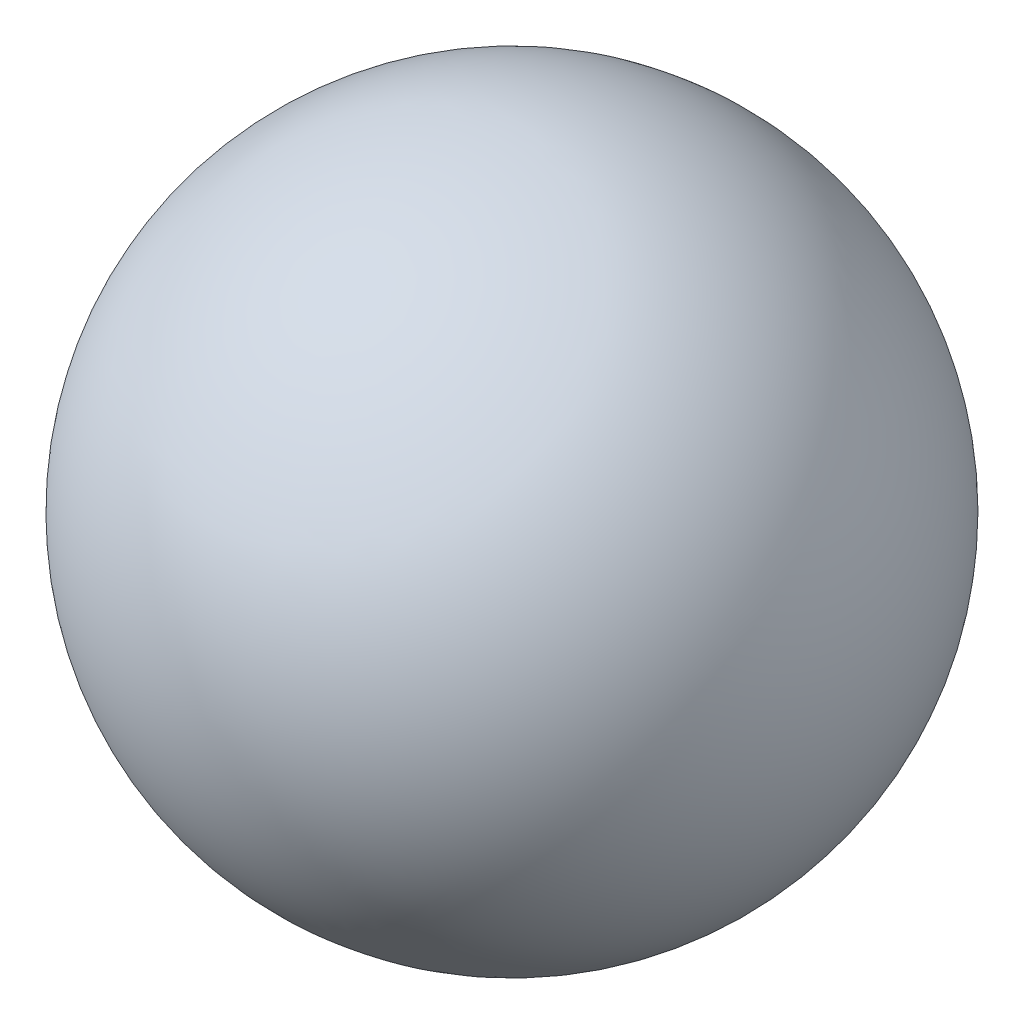
ISO-10303-21;
HEADER;
FILE_DESCRIPTION(('STEP AP214'),'2;1');
FILE_NAME('part.step','',(''),(''),'','','');
FILE_SCHEMA(('AUTOMOTIVE_DESIGN { 1 0 10303 214 1 1 1 1 }'));
ENDSEC;
DATA;
#1=APPLICATION_CONTEXT('core data for automotive mechanical design processes');
#2=APPLICATION_PROTOCOL_DEFINITION('international standard','automotive_design',2000,#1);
#3=PRODUCT_CONTEXT('',#1,'mechanical');
#4=PRODUCT('Part','Part','',(#3));
#5=PRODUCT_RELATED_PRODUCT_CATEGORY('part','',(#4));
#6=PRODUCT_DEFINITION_FORMATION('','',#4);
#7=PRODUCT_DEFINITION_CONTEXT('part definition',#1,'design');
#8=PRODUCT_DEFINITION('design','',#6,#7);
#9=PRODUCT_DEFINITION_SHAPE('','',#8);
#10=(LENGTH_UNIT() NAMED_UNIT(*) SI_UNIT(.MILLI.,.METRE.));
#11=(NAMED_UNIT(*) PLANE_ANGLE_UNIT() SI_UNIT($,.RADIAN.));
#12=(NAMED_UNIT(*) SI_UNIT($,.STERADIAN.) SOLID_ANGLE_UNIT());
#13=UNCERTAINTY_MEASURE_WITH_UNIT(LENGTH_MEASURE(1.E-05),#10,'distance_accuracy_value','');
#14=(GEOMETRIC_REPRESENTATION_CONTEXT(3) GLOBAL_UNCERTAINTY_ASSIGNED_CONTEXT((#13)) GLOBAL_UNIT_ASSIGNED_CONTEXT((#10,
#11,#12)) REPRESENTATION_CONTEXT('',''));
#15=CARTESIAN_POINT('',(0.,0.,0.));
#16=DIRECTION('',(0.,0.,1.));
#17=DIRECTION('',(1.,0.,0.));
#18=AXIS2_PLACEMENT_3D('',#15,#16,#17);
#19=CARTESIAN_POINT('',(64.16,61.8803514678688,-31.3818863552373));
#20=DIRECTION('',(0.,0.891866184337212,-0.452299357987365));
#21=DIRECTION('',(0.173648177666933,0.445427914428401,0.878316732984701));
#22=AXIS2_PLACEMENT_3D('',#19,#20,#21);
#23=SPHERICAL_SURFACE('',#22,7.15);
#24=CARTESIAN_POINT('',(64.16,55.5035082498577,-28.1479459456276));
#25=VERTEX_POINT('',#24);
#26=VERTEX_LOOP('',#25);
#27=FACE_BOUND('',#26,.T.);
#28=CARTESIAN_POINT('',(64.16,68.2571946858799,-34.615826764847));
#29=VERTEX_POINT('',#28);
#30=VERTEX_LOOP('',#29);
#31=FACE_BOUND('',#30,.T.);
#32=ADVANCED_FACE('F16',(#27,#31),#23,.T.);
#33=CLOSED_SHELL('',(#32));
#34=MANIFOLD_SOLID_BREP('B1',#33);
#35=ADVANCED_BREP_SHAPE_REPRESENTATION('',(#18,#34),#14);
#36=SHAPE_DEFINITION_REPRESENTATION(#9,#35);
ENDSEC;
END-ISO-10303-21;
